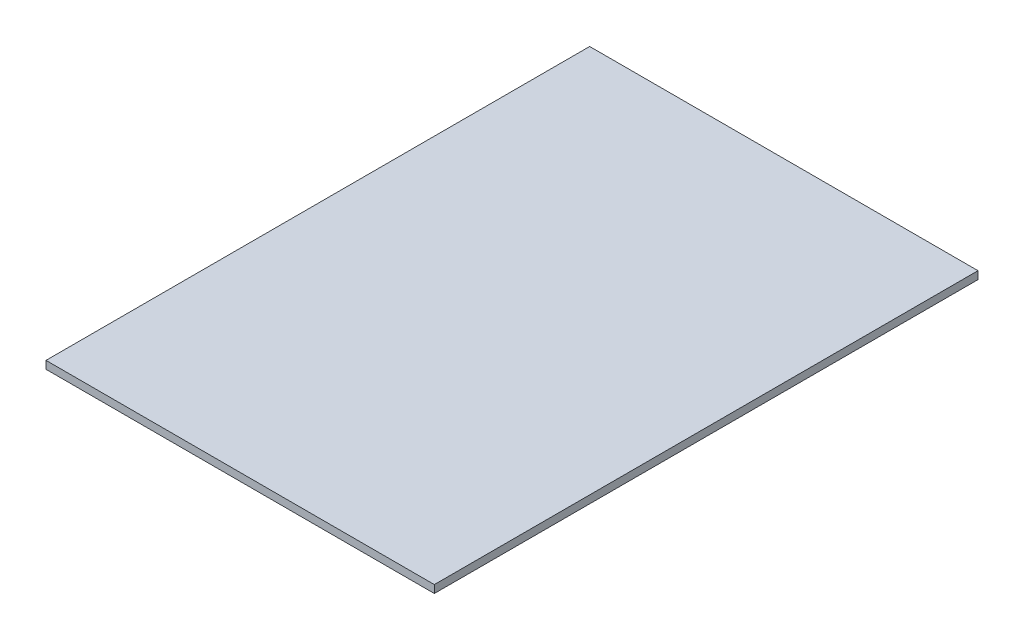
ISO-10303-21;
HEADER;
FILE_DESCRIPTION(('STEP AP214'),'2;1');
FILE_NAME('part.step','',(''),(''),'','','');
FILE_SCHEMA(('AUTOMOTIVE_DESIGN { 1 0 10303 214 1 1 1 1 }'));
ENDSEC;
DATA;
#1=APPLICATION_CONTEXT('core data for automotive mechanical design processes');
#2=APPLICATION_PROTOCOL_DEFINITION('international standard','automotive_design',2000,#1);
#3=PRODUCT_CONTEXT('',#1,'mechanical');
#4=PRODUCT('Part','Part','',(#3));
#5=PRODUCT_RELATED_PRODUCT_CATEGORY('part','',(#4));
#6=PRODUCT_DEFINITION_FORMATION('','',#4);
#7=PRODUCT_DEFINITION_CONTEXT('part definition',#1,'design');
#8=PRODUCT_DEFINITION('design','',#6,#7);
#9=PRODUCT_DEFINITION_SHAPE('','',#8);
#10=(LENGTH_UNIT() NAMED_UNIT(*) SI_UNIT(.MILLI.,.METRE.));
#11=(NAMED_UNIT(*) PLANE_ANGLE_UNIT() SI_UNIT($,.RADIAN.));
#12=(NAMED_UNIT(*) SI_UNIT($,.STERADIAN.) SOLID_ANGLE_UNIT());
#13=UNCERTAINTY_MEASURE_WITH_UNIT(LENGTH_MEASURE(1.E-05),#10,'distance_accuracy_value','');
#14=(GEOMETRIC_REPRESENTATION_CONTEXT(3) GLOBAL_UNCERTAINTY_ASSIGNED_CONTEXT((#13)) GLOBAL_UNIT_ASSIGNED_CONTEXT((#10,
#11,#12)) REPRESENTATION_CONTEXT('',''));
#15=CARTESIAN_POINT('',(0.,0.,0.));
#16=DIRECTION('',(0.,0.,1.));
#17=DIRECTION('',(1.,0.,0.));
#18=AXIS2_PLACEMENT_3D('',#15,#16,#17);
#19=CARTESIAN_POINT('',(0.,5.,0.));
#20=DIRECTION('',(1.,0.,0.));
#21=DIRECTION('',(0.,0.,-1.));
#22=AXIS2_PLACEMENT_3D('',#19,#20,#21);
#23=PLANE('',#22);
#24=DIRECTION('',(0.,0.,1.));
#25=VECTOR('',#24,1.);
#26=CARTESIAN_POINT('',(0.,0.,0.));
#27=LINE('',#26,#25);
#28=CARTESIAN_POINT('',(0.,0.,-350.));
#29=VERTEX_POINT('',#28);
#30=CARTESIAN_POINT('',(0.,0.,0.));
#31=VERTEX_POINT('',#30);
#32=EDGE_CURVE('E99',#29,#31,#27,.T.);
#33=ORIENTED_EDGE('',*,*,#32,.T.);
#34=DIRECTION('',(0.,-1.,0.));
#35=VECTOR('',#34,1.);
#36=CARTESIAN_POINT('',(0.,5.,0.));
#37=LINE('',#36,#35);
#38=CARTESIAN_POINT('',(0.,5.,0.));
#39=VERTEX_POINT('',#38);
#40=EDGE_CURVE('E11',#39,#31,#37,.T.);
#41=ORIENTED_EDGE('',*,*,#40,.F.);
#42=DIRECTION('',(0.,0.,1.));
#43=VECTOR('',#42,1.);
#44=CARTESIAN_POINT('',(0.,5.,0.));
#45=LINE('',#44,#43);
#46=CARTESIAN_POINT('',(0.,5.,-350.));
#47=VERTEX_POINT('',#46);
#48=EDGE_CURVE('E87',#47,#39,#45,.T.);
#49=ORIENTED_EDGE('',*,*,#48,.F.);
#50=DIRECTION('',(0.,-1.,0.));
#51=VECTOR('',#50,1.);
#52=CARTESIAN_POINT('',(0.,5.,-350.));
#53=LINE('',#52,#51);
#54=EDGE_CURVE('E95',#47,#29,#53,.T.);
#55=ORIENTED_EDGE('',*,*,#54,.T.);
#56=EDGE_LOOP('',(#33,#41,#49,#55));
#57=FACE_BOUND('',#56,.T.);
#58=ADVANCED_FACE('F36',(#57),#23,.F.);
#59=CARTESIAN_POINT('',(0.,5.,0.));
#60=DIRECTION('',(0.,0.,-1.));
#61=DIRECTION('',(-1.,0.,0.));
#62=AXIS2_PLACEMENT_3D('',#59,#60,#61);
#63=PLANE('',#62);
#64=DIRECTION('',(1.,0.,0.));
#65=VECTOR('',#64,1.);
#66=CARTESIAN_POINT('',(0.,0.,0.));
#67=LINE('',#66,#65);
#68=CARTESIAN_POINT('',(250.,0.,0.));
#69=VERTEX_POINT('',#68);
#70=EDGE_CURVE('E91',#31,#69,#67,.T.);
#71=ORIENTED_EDGE('',*,*,#70,.T.);
#72=DIRECTION('',(0.,-1.,0.));
#73=VECTOR('',#72,1.);
#74=CARTESIAN_POINT('',(250.,5.,0.));
#75=LINE('',#74,#73);
#76=CARTESIAN_POINT('',(250.,5.,0.));
#77=VERTEX_POINT('',#76);
#78=EDGE_CURVE('E44',#77,#69,#75,.T.);
#79=ORIENTED_EDGE('',*,*,#78,.F.);
#80=DIRECTION('',(1.,0.,0.));
#81=VECTOR('',#80,1.);
#82=CARTESIAN_POINT('',(0.,5.,0.));
#83=LINE('',#82,#81);
#84=EDGE_CURVE('E82',#39,#77,#83,.T.);
#85=ORIENTED_EDGE('',*,*,#84,.F.);
#86=ORIENTED_EDGE('',*,*,#40,.T.);
#87=EDGE_LOOP('',(#71,#79,#85,#86));
#88=FACE_BOUND('',#87,.T.);
#89=ADVANCED_FACE('F90',(#88),#63,.F.);
#90=CARTESIAN_POINT('',(250.,5.,0.));
#91=DIRECTION('',(-1.,0.,0.));
#92=DIRECTION('',(0.,0.,1.));
#93=AXIS2_PLACEMENT_3D('',#90,#91,#92);
#94=PLANE('',#93);
#95=DIRECTION('',(0.,0.,-1.));
#96=VECTOR('',#95,1.);
#97=CARTESIAN_POINT('',(250.,0.,0.));
#98=LINE('',#97,#96);
#99=CARTESIAN_POINT('',(250.,0.,-350.));
#100=VERTEX_POINT('',#99);
#101=EDGE_CURVE('E69',#69,#100,#98,.T.);
#102=ORIENTED_EDGE('',*,*,#101,.T.);
#103=DIRECTION('',(0.,-1.,0.));
#104=VECTOR('',#103,1.);
#105=CARTESIAN_POINT('',(250.,5.,-350.));
#106=LINE('',#105,#104);
#107=CARTESIAN_POINT('',(250.,5.,-350.));
#108=VERTEX_POINT('',#107);
#109=EDGE_CURVE('E92',#108,#100,#106,.T.);
#110=ORIENTED_EDGE('',*,*,#109,.F.);
#111=DIRECTION('',(0.,0.,-1.));
#112=VECTOR('',#111,1.);
#113=CARTESIAN_POINT('',(250.,5.,0.));
#114=LINE('',#113,#112);
#115=EDGE_CURVE('E85',#77,#108,#114,.T.);
#116=ORIENTED_EDGE('',*,*,#115,.F.);
#117=ORIENTED_EDGE('',*,*,#78,.T.);
#118=EDGE_LOOP('',(#102,#110,#116,#117));
#119=FACE_BOUND('',#118,.T.);
#120=ADVANCED_FACE('F93',(#119),#94,.F.);
#121=CARTESIAN_POINT('',(0.,5.,-350.));
#122=DIRECTION('',(0.,0.,1.));
#123=DIRECTION('',(1.,0.,0.));
#124=AXIS2_PLACEMENT_3D('',#121,#122,#123);
#125=PLANE('',#124);
#126=DIRECTION('',(-1.,0.,0.));
#127=VECTOR('',#126,1.);
#128=CARTESIAN_POINT('',(0.,0.,-350.));
#129=LINE('',#128,#127);
#130=EDGE_CURVE('E75',#100,#29,#129,.T.);
#131=ORIENTED_EDGE('',*,*,#130,.T.);
#132=ORIENTED_EDGE('',*,*,#54,.F.);
#133=DIRECTION('',(-1.,0.,0.));
#134=VECTOR('',#133,1.);
#135=CARTESIAN_POINT('',(0.,5.,-350.));
#136=LINE('',#135,#134);
#137=EDGE_CURVE('E52',#108,#47,#136,.T.);
#138=ORIENTED_EDGE('',*,*,#137,.F.);
#139=ORIENTED_EDGE('',*,*,#109,.T.);
#140=EDGE_LOOP('',(#131,#132,#138,#139));
#141=FACE_BOUND('',#140,.T.);
#142=ADVANCED_FACE('F106',(#141),#125,.F.);
#143=CARTESIAN_POINT('',(0.,5.,0.));
#144=DIRECTION('',(0.,-1.,0.));
#145=DIRECTION('',(0.,0.,-1.));
#146=AXIS2_PLACEMENT_3D('',#143,#144,#145);
#147=PLANE('',#146);
#148=ORIENTED_EDGE('',*,*,#48,.T.);
#149=ORIENTED_EDGE('',*,*,#84,.T.);
#150=ORIENTED_EDGE('',*,*,#115,.T.);
#151=ORIENTED_EDGE('',*,*,#137,.T.);
#152=EDGE_LOOP('',(#148,#149,#150,#151));
#153=FACE_BOUND('',#152,.T.);
#154=ADVANCED_FACE('F83',(#153),#147,.F.);
#155=CARTESIAN_POINT('',(0.,0.,0.));
#156=DIRECTION('',(0.,-1.,0.));
#157=DIRECTION('',(0.,0.,-1.));
#158=AXIS2_PLACEMENT_3D('',#155,#156,#157);
#159=PLANE('',#158);
#160=ORIENTED_EDGE('',*,*,#32,.F.);
#161=ORIENTED_EDGE('',*,*,#130,.F.);
#162=ORIENTED_EDGE('',*,*,#101,.F.);
#163=ORIENTED_EDGE('',*,*,#70,.F.);
#164=EDGE_LOOP('',(#160,#161,#162,#163));
#165=FACE_BOUND('',#164,.T.);
#166=ADVANCED_FACE('F109',(#165),#159,.T.);
#167=CLOSED_SHELL('',(#58,#89,#120,#142,#154,#166));
#168=MANIFOLD_SOLID_BREP('B2',#167);
#169=ADVANCED_BREP_SHAPE_REPRESENTATION('',(#18,#168),#14);
#170=SHAPE_DEFINITION_REPRESENTATION(#9,#169);
ENDSEC;
END-ISO-10303-21;
